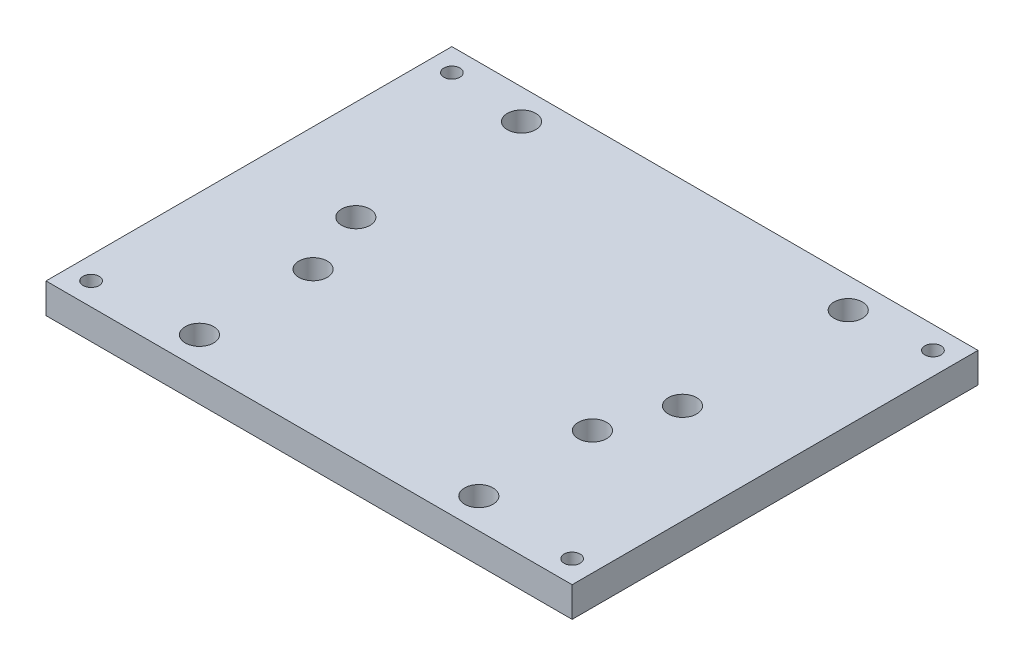
ISO-10303-21;
HEADER;
FILE_DESCRIPTION(('STEP AP214'),'2;1');
FILE_NAME('part.step','',(''),(''),'','','');
FILE_SCHEMA(('AUTOMOTIVE_DESIGN { 1 0 10303 214 1 1 1 1 }'));
ENDSEC;
DATA;
#1=APPLICATION_CONTEXT('core data for automotive mechanical design processes');
#2=APPLICATION_PROTOCOL_DEFINITION('international standard','automotive_design',2000,#1);
#3=PRODUCT_CONTEXT('',#1,'mechanical');
#4=PRODUCT('Part','Part','',(#3));
#5=PRODUCT_RELATED_PRODUCT_CATEGORY('part','',(#4));
#6=PRODUCT_DEFINITION_FORMATION('','',#4);
#7=PRODUCT_DEFINITION_CONTEXT('part definition',#1,'design');
#8=PRODUCT_DEFINITION('design','',#6,#7);
#9=PRODUCT_DEFINITION_SHAPE('','',#8);
#10=(LENGTH_UNIT() NAMED_UNIT(*) SI_UNIT(.MILLI.,.METRE.));
#11=(NAMED_UNIT(*) PLANE_ANGLE_UNIT() SI_UNIT($,.RADIAN.));
#12=(NAMED_UNIT(*) SI_UNIT($,.STERADIAN.) SOLID_ANGLE_UNIT());
#13=UNCERTAINTY_MEASURE_WITH_UNIT(LENGTH_MEASURE(1.E-05),#10,'distance_accuracy_value','');
#14=(GEOMETRIC_REPRESENTATION_CONTEXT(3) GLOBAL_UNCERTAINTY_ASSIGNED_CONTEXT((#13)) GLOBAL_UNIT_ASSIGNED_CONTEXT((#10,
#11,#12)) REPRESENTATION_CONTEXT('',''));
#15=CARTESIAN_POINT('',(0.,0.,0.));
#16=DIRECTION('',(0.,0.,1.));
#17=DIRECTION('',(1.,0.,0.));
#18=AXIS2_PLACEMENT_3D('',#15,#16,#17);
#19=CARTESIAN_POINT('',(-55.5625,6.35,42.8625));
#20=DIRECTION('',(1.,0.,0.));
#21=DIRECTION('',(0.,0.,-1.));
#22=AXIS2_PLACEMENT_3D('',#19,#20,#21);
#23=PLANE('',#22);
#24=DIRECTION('',(0.,0.,1.));
#25=VECTOR('',#24,1.);
#26=CARTESIAN_POINT('',(-55.5625,0.,42.8625));
#27=LINE('',#26,#25);
#28=CARTESIAN_POINT('',(-55.5625,0.,-42.8625));
#29=VERTEX_POINT('',#28);
#30=CARTESIAN_POINT('',(-55.5625,0.,42.8625));
#31=VERTEX_POINT('',#30);
#32=EDGE_CURVE('E98',#29,#31,#27,.T.);
#33=ORIENTED_EDGE('',*,*,#32,.T.);
#34=DIRECTION('',(0.,-1.,0.));
#35=VECTOR('',#34,1.);
#36=CARTESIAN_POINT('',(-55.5625,6.35,42.8625));
#37=LINE('',#36,#35);
#38=CARTESIAN_POINT('',(-55.5625,6.35,42.8625));
#39=VERTEX_POINT('',#38);
#40=EDGE_CURVE('E11',#39,#31,#37,.T.);
#41=ORIENTED_EDGE('',*,*,#40,.F.);
#42=DIRECTION('',(0.,0.,1.));
#43=VECTOR('',#42,1.);
#44=CARTESIAN_POINT('',(-55.5625,6.35,42.8625));
#45=LINE('',#44,#43);
#46=CARTESIAN_POINT('',(-55.5625,6.35,-42.8625));
#47=VERTEX_POINT('',#46);
#48=EDGE_CURVE('E86',#47,#39,#45,.T.);
#49=ORIENTED_EDGE('',*,*,#48,.F.);
#50=DIRECTION('',(0.,-1.,0.));
#51=VECTOR('',#50,1.);
#52=CARTESIAN_POINT('',(-55.5625,6.35,-42.8625));
#53=LINE('',#52,#51);
#54=EDGE_CURVE('E94',#47,#29,#53,.T.);
#55=ORIENTED_EDGE('',*,*,#54,.T.);
#56=EDGE_LOOP('',(#33,#41,#49,#55));
#57=FACE_BOUND('',#56,.T.);
#58=ADVANCED_FACE('F35',(#57),#23,.F.);
#59=CARTESIAN_POINT('',(-55.5625,6.35,42.8625));
#60=DIRECTION('',(0.,0.,-1.));
#61=DIRECTION('',(-1.,0.,0.));
#62=AXIS2_PLACEMENT_3D('',#59,#60,#61);
#63=PLANE('',#62);
#64=DIRECTION('',(1.,0.,0.));
#65=VECTOR('',#64,1.);
#66=CARTESIAN_POINT('',(-55.5625,0.,42.8625));
#67=LINE('',#66,#65);
#68=CARTESIAN_POINT('',(55.5625,0.,42.8625));
#69=VERTEX_POINT('',#68);
#70=EDGE_CURVE('E90',#31,#69,#67,.T.);
#71=ORIENTED_EDGE('',*,*,#70,.T.);
#72=DIRECTION('',(0.,-1.,0.));
#73=VECTOR('',#72,1.);
#74=CARTESIAN_POINT('',(55.5625,6.35,42.8625));
#75=LINE('',#74,#73);
#76=CARTESIAN_POINT('',(55.5625,6.35,42.8625));
#77=VERTEX_POINT('',#76);
#78=EDGE_CURVE('E43',#77,#69,#75,.T.);
#79=ORIENTED_EDGE('',*,*,#78,.F.);
#80=DIRECTION('',(1.,0.,0.));
#81=VECTOR('',#80,1.);
#82=CARTESIAN_POINT('',(-55.5625,6.35,42.8625));
#83=LINE('',#82,#81);
#84=EDGE_CURVE('E81',#39,#77,#83,.T.);
#85=ORIENTED_EDGE('',*,*,#84,.F.);
#86=ORIENTED_EDGE('',*,*,#40,.T.);
#87=EDGE_LOOP('',(#71,#79,#85,#86));
#88=FACE_BOUND('',#87,.T.);
#89=ADVANCED_FACE('F89',(#88),#63,.F.);
#90=CARTESIAN_POINT('',(55.5625,6.35,42.8625));
#91=DIRECTION('',(-1.,0.,0.));
#92=DIRECTION('',(0.,0.,1.));
#93=AXIS2_PLACEMENT_3D('',#90,#91,#92);
#94=PLANE('',#93);
#95=DIRECTION('',(0.,0.,-1.));
#96=VECTOR('',#95,1.);
#97=CARTESIAN_POINT('',(55.5625,0.,42.8625));
#98=LINE('',#97,#96);
#99=CARTESIAN_POINT('',(55.5625,0.,-42.8625));
#100=VERTEX_POINT('',#99);
#101=EDGE_CURVE('E68',#69,#100,#98,.T.);
#102=ORIENTED_EDGE('',*,*,#101,.T.);
#103=DIRECTION('',(0.,-1.,0.));
#104=VECTOR('',#103,1.);
#105=CARTESIAN_POINT('',(55.5625,6.35,-42.8625));
#106=LINE('',#105,#104);
#107=CARTESIAN_POINT('',(55.5625,6.35,-42.8625));
#108=VERTEX_POINT('',#107);
#109=EDGE_CURVE('E91',#108,#100,#106,.T.);
#110=ORIENTED_EDGE('',*,*,#109,.F.);
#111=DIRECTION('',(0.,0.,-1.));
#112=VECTOR('',#111,1.);
#113=CARTESIAN_POINT('',(55.5625,6.35,42.8625));
#114=LINE('',#113,#112);
#115=EDGE_CURVE('E84',#77,#108,#114,.T.);
#116=ORIENTED_EDGE('',*,*,#115,.F.);
#117=ORIENTED_EDGE('',*,*,#78,.T.);
#118=EDGE_LOOP('',(#102,#110,#116,#117));
#119=FACE_BOUND('',#118,.T.);
#120=ADVANCED_FACE('F92',(#119),#94,.F.);
#121=CARTESIAN_POINT('',(-55.5625,6.35,-42.8625));
#122=DIRECTION('',(0.,0.,1.));
#123=DIRECTION('',(1.,0.,0.));
#124=AXIS2_PLACEMENT_3D('',#121,#122,#123);
#125=PLANE('',#124);
#126=DIRECTION('',(-1.,0.,0.));
#127=VECTOR('',#126,1.);
#128=CARTESIAN_POINT('',(-55.5625,0.,-42.8625));
#129=LINE('',#128,#127);
#130=EDGE_CURVE('E74',#100,#29,#129,.T.);
#131=ORIENTED_EDGE('',*,*,#130,.T.);
#132=ORIENTED_EDGE('',*,*,#54,.F.);
#133=DIRECTION('',(-1.,0.,0.));
#134=VECTOR('',#133,1.);
#135=CARTESIAN_POINT('',(-55.5625,6.35,-42.8625));
#136=LINE('',#135,#134);
#137=EDGE_CURVE('E51',#108,#47,#136,.T.);
#138=ORIENTED_EDGE('',*,*,#137,.F.);
#139=ORIENTED_EDGE('',*,*,#109,.T.);
#140=EDGE_LOOP('',(#131,#132,#138,#139));
#141=FACE_BOUND('',#140,.T.);
#142=ADVANCED_FACE('F106',(#141),#125,.F.);
#143=CARTESIAN_POINT('',(0.,6.35,0.));
#144=DIRECTION('',(0.,-1.,0.));
#145=DIRECTION('',(0.,0.,-1.));
#146=AXIS2_PLACEMENT_3D('',#143,#144,#145);
#147=PLANE('',#146);
#148=CARTESIAN_POINT('',(34.5,6.35,-36.5125));
#149=DIRECTION('',(0.,1.,0.));
#150=DIRECTION('',(0.,0.,1.));
#151=AXIS2_PLACEMENT_3D('',#148,#149,#150);
#152=CIRCLE('',#151,3.);
#153=CARTESIAN_POINT('',(34.5,6.35,-33.5125));
#154=VERTEX_POINT('',#153);
#155=EDGE_CURVE('E161',#154,#154,#152,.T.);
#156=ORIENTED_EDGE('',*,*,#155,.F.);
#157=EDGE_LOOP('',(#156));
#158=FACE_BOUND('',#157,.T.);
#159=CARTESIAN_POINT('',(34.5,6.35,-1.51249999999999));
#160=DIRECTION('',(0.,1.,0.));
#161=DIRECTION('',(0.,0.,1.));
#162=AXIS2_PLACEMENT_3D('',#159,#160,#161);
#163=CIRCLE('',#162,3.);
#164=CARTESIAN_POINT('',(34.5,6.35,1.48750000000001));
#165=VERTEX_POINT('',#164);
#166=EDGE_CURVE('E155',#165,#165,#163,.T.);
#167=ORIENTED_EDGE('',*,*,#166,.F.);
#168=EDGE_LOOP('',(#167));
#169=FACE_BOUND('',#168,.T.);
#170=CARTESIAN_POINT('',(-34.5,6.35,-1.51249999999999));
#171=DIRECTION('',(0.,1.,0.));
#172=DIRECTION('',(0.,0.,1.));
#173=AXIS2_PLACEMENT_3D('',#170,#171,#172);
#174=CIRCLE('',#173,3.);
#175=CARTESIAN_POINT('',(-34.5,6.35,1.48750000000001));
#176=VERTEX_POINT('',#175);
#177=EDGE_CURVE('E149',#176,#176,#174,.T.);
#178=ORIENTED_EDGE('',*,*,#177,.F.);
#179=EDGE_LOOP('',(#178));
#180=FACE_BOUND('',#179,.T.);
#181=CARTESIAN_POINT('',(-29.5,6.35,12.5125));
#182=DIRECTION('',(0.,1.,0.));
#183=DIRECTION('',(0.,0.,1.));
#184=AXIS2_PLACEMENT_3D('',#181,#182,#183);
#185=CIRCLE('',#184,3.);
#186=CARTESIAN_POINT('',(-29.5,6.35,15.5125));
#187=VERTEX_POINT('',#186);
#188=EDGE_CURVE('E142',#187,#187,#185,.T.);
#189=ORIENTED_EDGE('',*,*,#188,.F.);
#190=EDGE_LOOP('',(#189));
#191=FACE_BOUND('',#190,.T.);
#192=CARTESIAN_POINT('',(-29.5,6.35,36.5125));
#193=DIRECTION('',(0.,1.,0.));
#194=DIRECTION('',(0.,0.,1.));
#195=AXIS2_PLACEMENT_3D('',#192,#193,#194);
#196=CIRCLE('',#195,3.);
#197=CARTESIAN_POINT('',(-29.5,6.35,39.5125));
#198=VERTEX_POINT('',#197);
#199=EDGE_CURVE('E178',#198,#198,#196,.T.);
#200=ORIENTED_EDGE('',*,*,#199,.F.);
#201=EDGE_LOOP('',(#200));
#202=FACE_BOUND('',#201,.T.);
#203=CARTESIAN_POINT('',(29.5,6.35,36.5125));
#204=DIRECTION('',(0.,1.,0.));
#205=DIRECTION('',(0.,0.,1.));
#206=AXIS2_PLACEMENT_3D('',#203,#204,#205);
#207=CIRCLE('',#206,3.);
#208=CARTESIAN_POINT('',(29.5,6.35,39.5125));
#209=VERTEX_POINT('',#208);
#210=EDGE_CURVE('E172',#209,#209,#207,.T.);
#211=ORIENTED_EDGE('',*,*,#210,.F.);
#212=EDGE_LOOP('',(#211));
#213=FACE_BOUND('',#212,.T.);
#214=CARTESIAN_POINT('',(29.5,6.35,12.5125));
#215=DIRECTION('',(0.,1.,0.));
#216=DIRECTION('',(0.,0.,1.));
#217=AXIS2_PLACEMENT_3D('',#214,#215,#216);
#218=CIRCLE('',#217,3.);
#219=CARTESIAN_POINT('',(29.5,6.35,15.5125));
#220=VERTEX_POINT('',#219);
#221=EDGE_CURVE('E166',#220,#220,#218,.T.);
#222=ORIENTED_EDGE('',*,*,#221,.F.);
#223=EDGE_LOOP('',(#222));
#224=FACE_BOUND('',#223,.T.);
#225=CARTESIAN_POINT('',(-34.5,6.35,-36.5125));
#226=DIRECTION('',(0.,1.,0.));
#227=DIRECTION('',(0.,0.,1.));
#228=AXIS2_PLACEMENT_3D('',#225,#226,#227);
#229=CIRCLE('',#228,3.);
#230=CARTESIAN_POINT('',(-34.5,6.35,-33.5125));
#231=VERTEX_POINT('',#230);
#232=EDGE_CURVE('E136',#231,#231,#229,.T.);
#233=ORIENTED_EDGE('',*,*,#232,.F.);
#234=EDGE_LOOP('',(#233));
#235=FACE_BOUND('',#234,.T.);
#236=CARTESIAN_POINT('',(-50.8,6.35,38.1));
#237=DIRECTION('',(0.,-1.,0.));
#238=DIRECTION('',(0.,0.,-1.));
#239=AXIS2_PLACEMENT_3D('',#236,#237,#238);
#240=CIRCLE('',#239,1.7);
#241=CARTESIAN_POINT('',(-50.8,6.35,36.4));
#242=VERTEX_POINT('',#241);
#243=EDGE_CURVE('E129',#242,#242,#240,.T.);
#244=ORIENTED_EDGE('',*,*,#243,.T.);
#245=EDGE_LOOP('',(#244));
#246=FACE_BOUND('',#245,.T.);
#247=CARTESIAN_POINT('',(50.8,6.35,38.1));
#248=DIRECTION('',(0.,-1.,0.));
#249=DIRECTION('',(0.,0.,-1.));
#250=AXIS2_PLACEMENT_3D('',#247,#248,#249);
#251=CIRCLE('',#250,1.7);
#252=CARTESIAN_POINT('',(50.8,6.35,36.4));
#253=VERTEX_POINT('',#252);
#254=EDGE_CURVE('E123',#253,#253,#251,.T.);
#255=ORIENTED_EDGE('',*,*,#254,.T.);
#256=EDGE_LOOP('',(#255));
#257=FACE_BOUND('',#256,.T.);
#258=CARTESIAN_POINT('',(-50.8,6.35,-38.1));
#259=DIRECTION('',(0.,-1.,0.));
#260=DIRECTION('',(0.,0.,-1.));
#261=AXIS2_PLACEMENT_3D('',#258,#259,#260);
#262=CIRCLE('',#261,1.7);
#263=CARTESIAN_POINT('',(-50.8,6.35,-39.8));
#264=VERTEX_POINT('',#263);
#265=EDGE_CURVE('E117',#264,#264,#262,.T.);
#266=ORIENTED_EDGE('',*,*,#265,.T.);
#267=EDGE_LOOP('',(#266));
#268=FACE_BOUND('',#267,.T.);
#269=CARTESIAN_POINT('',(50.8,6.35,-38.1));
#270=DIRECTION('',(0.,-1.,0.));
#271=DIRECTION('',(0.,0.,-1.));
#272=AXIS2_PLACEMENT_3D('',#269,#270,#271);
#273=CIRCLE('',#272,1.7);
#274=CARTESIAN_POINT('',(50.8,6.35,-39.8));
#275=VERTEX_POINT('',#274);
#276=EDGE_CURVE('E101',#275,#275,#273,.T.);
#277=ORIENTED_EDGE('',*,*,#276,.T.);
#278=EDGE_LOOP('',(#277));
#279=FACE_BOUND('',#278,.T.);
#280=ORIENTED_EDGE('',*,*,#48,.T.);
#281=ORIENTED_EDGE('',*,*,#84,.T.);
#282=ORIENTED_EDGE('',*,*,#115,.T.);
#283=ORIENTED_EDGE('',*,*,#137,.T.);
#284=EDGE_LOOP('',(#280,#281,#282,#283));
#285=FACE_BOUND('',#284,.T.);
#286=ADVANCED_FACE('F82',(#158,#169,#180,#191,#202,#213,#224,#235,#246,#257,#268,#279,#285),
#147,.F.);
#287=CARTESIAN_POINT('',(0.,0.,0.));
#288=DIRECTION('',(0.,-1.,0.));
#289=DIRECTION('',(0.,0.,-1.));
#290=AXIS2_PLACEMENT_3D('',#287,#288,#289);
#291=PLANE('',#290);
#292=CARTESIAN_POINT('',(34.5,0.,-36.5125));
#293=DIRECTION('',(0.,1.,0.));
#294=DIRECTION('',(0.,0.,1.));
#295=AXIS2_PLACEMENT_3D('',#292,#293,#294);
#296=CIRCLE('',#295,3.);
#297=CARTESIAN_POINT('',(34.5,0.,-33.5125));
#298=VERTEX_POINT('',#297);
#299=EDGE_CURVE('E139',#298,#298,#296,.T.);
#300=ORIENTED_EDGE('',*,*,#299,.T.);
#301=EDGE_LOOP('',(#300));
#302=FACE_BOUND('',#301,.T.);
#303=CARTESIAN_POINT('',(34.5,0.,-1.51249999999999));
#304=DIRECTION('',(0.,1.,0.));
#305=DIRECTION('',(0.,0.,1.));
#306=AXIS2_PLACEMENT_3D('',#303,#304,#305);
#307=CIRCLE('',#306,3.);
#308=CARTESIAN_POINT('',(34.5,0.,1.48750000000001));
#309=VERTEX_POINT('',#308);
#310=EDGE_CURVE('E158',#309,#309,#307,.T.);
#311=ORIENTED_EDGE('',*,*,#310,.T.);
#312=EDGE_LOOP('',(#311));
#313=FACE_BOUND('',#312,.T.);
#314=CARTESIAN_POINT('',(-34.5,0.,-1.51249999999999));
#315=DIRECTION('',(0.,1.,0.));
#316=DIRECTION('',(0.,0.,1.));
#317=AXIS2_PLACEMENT_3D('',#314,#315,#316);
#318=CIRCLE('',#317,3.);
#319=CARTESIAN_POINT('',(-34.5,0.,1.48750000000001));
#320=VERTEX_POINT('',#319);
#321=EDGE_CURVE('E152',#320,#320,#318,.T.);
#322=ORIENTED_EDGE('',*,*,#321,.T.);
#323=EDGE_LOOP('',(#322));
#324=FACE_BOUND('',#323,.T.);
#325=CARTESIAN_POINT('',(-29.5,0.,12.5125));
#326=DIRECTION('',(0.,1.,0.));
#327=DIRECTION('',(0.,0.,1.));
#328=AXIS2_PLACEMENT_3D('',#325,#326,#327);
#329=CIRCLE('',#328,3.);
#330=CARTESIAN_POINT('',(-29.5,0.,15.5125));
#331=VERTEX_POINT('',#330);
#332=EDGE_CURVE('E145',#331,#331,#329,.T.);
#333=ORIENTED_EDGE('',*,*,#332,.T.);
#334=EDGE_LOOP('',(#333));
#335=FACE_BOUND('',#334,.T.);
#336=CARTESIAN_POINT('',(-29.5,0.,36.5125));
#337=DIRECTION('',(0.,1.,0.));
#338=DIRECTION('',(0.,0.,1.));
#339=AXIS2_PLACEMENT_3D('',#336,#337,#338);
#340=CIRCLE('',#339,3.);
#341=CARTESIAN_POINT('',(-29.5,0.,39.5125));
#342=VERTEX_POINT('',#341);
#343=EDGE_CURVE('E146',#342,#342,#340,.T.);
#344=ORIENTED_EDGE('',*,*,#343,.T.);
#345=EDGE_LOOP('',(#344));
#346=FACE_BOUND('',#345,.T.);
#347=CARTESIAN_POINT('',(29.5,0.,36.5125));
#348=DIRECTION('',(0.,1.,0.));
#349=DIRECTION('',(0.,0.,1.));
#350=AXIS2_PLACEMENT_3D('',#347,#348,#349);
#351=CIRCLE('',#350,3.);
#352=CARTESIAN_POINT('',(29.5,0.,39.5125));
#353=VERTEX_POINT('',#352);
#354=EDGE_CURVE('E175',#353,#353,#351,.T.);
#355=ORIENTED_EDGE('',*,*,#354,.T.);
#356=EDGE_LOOP('',(#355));
#357=FACE_BOUND('',#356,.T.);
#358=CARTESIAN_POINT('',(29.5,0.,12.5125));
#359=DIRECTION('',(0.,1.,0.));
#360=DIRECTION('',(0.,0.,1.));
#361=AXIS2_PLACEMENT_3D('',#358,#359,#360);
#362=CIRCLE('',#361,3.);
#363=CARTESIAN_POINT('',(29.5,0.,15.5125));
#364=VERTEX_POINT('',#363);
#365=EDGE_CURVE('E169',#364,#364,#362,.T.);
#366=ORIENTED_EDGE('',*,*,#365,.T.);
#367=EDGE_LOOP('',(#366));
#368=FACE_BOUND('',#367,.T.);
#369=CARTESIAN_POINT('',(-34.5,0.,-36.5125));
#370=DIRECTION('',(0.,1.,0.));
#371=DIRECTION('',(0.,0.,1.));
#372=AXIS2_PLACEMENT_3D('',#369,#370,#371);
#373=CIRCLE('',#372,3.);
#374=CARTESIAN_POINT('',(-34.5,0.,-33.5125));
#375=VERTEX_POINT('',#374);
#376=EDGE_CURVE('E135',#375,#375,#373,.T.);
#377=ORIENTED_EDGE('',*,*,#376,.T.);
#378=EDGE_LOOP('',(#377));
#379=FACE_BOUND('',#378,.T.);
#380=CARTESIAN_POINT('',(-50.8,0.,38.1));
#381=DIRECTION('',(0.,-1.,0.));
#382=DIRECTION('',(0.,0.,-1.));
#383=AXIS2_PLACEMENT_3D('',#380,#381,#382);
#384=CIRCLE('',#383,1.69999999999999);
#385=CARTESIAN_POINT('',(-50.8,0.,36.4));
#386=VERTEX_POINT('',#385);
#387=EDGE_CURVE('E132',#386,#386,#384,.T.);
#388=ORIENTED_EDGE('',*,*,#387,.F.);
#389=EDGE_LOOP('',(#388));
#390=FACE_BOUND('',#389,.T.);
#391=CARTESIAN_POINT('',(50.8,0.,38.1));
#392=DIRECTION('',(0.,-1.,0.));
#393=DIRECTION('',(0.,0.,-1.));
#394=AXIS2_PLACEMENT_3D('',#391,#392,#393);
#395=CIRCLE('',#394,1.69999999999999);
#396=CARTESIAN_POINT('',(50.8,0.,36.4));
#397=VERTEX_POINT('',#396);
#398=EDGE_CURVE('E126',#397,#397,#395,.T.);
#399=ORIENTED_EDGE('',*,*,#398,.F.);
#400=EDGE_LOOP('',(#399));
#401=FACE_BOUND('',#400,.T.);
#402=CARTESIAN_POINT('',(-50.8,0.,-38.1));
#403=DIRECTION('',(0.,-1.,0.));
#404=DIRECTION('',(0.,0.,-1.));
#405=AXIS2_PLACEMENT_3D('',#402,#403,#404);
#406=CIRCLE('',#405,1.69999999999999);
#407=CARTESIAN_POINT('',(-50.8,0.,-39.8));
#408=VERTEX_POINT('',#407);
#409=EDGE_CURVE('E120',#408,#408,#406,.T.);
#410=ORIENTED_EDGE('',*,*,#409,.F.);
#411=EDGE_LOOP('',(#410));
#412=FACE_BOUND('',#411,.T.);
#413=CARTESIAN_POINT('',(50.8,0.,-38.1));
#414=DIRECTION('',(0.,-1.,0.));
#415=DIRECTION('',(0.,0.,-1.));
#416=AXIS2_PLACEMENT_3D('',#413,#414,#415);
#417=CIRCLE('',#416,1.69999999999999);
#418=CARTESIAN_POINT('',(50.8,0.,-39.8));
#419=VERTEX_POINT('',#418);
#420=EDGE_CURVE('E114',#419,#419,#417,.T.);
#421=ORIENTED_EDGE('',*,*,#420,.F.);
#422=EDGE_LOOP('',(#421));
#423=FACE_BOUND('',#422,.T.);
#424=ORIENTED_EDGE('',*,*,#32,.F.);
#425=ORIENTED_EDGE('',*,*,#130,.F.);
#426=ORIENTED_EDGE('',*,*,#101,.F.);
#427=ORIENTED_EDGE('',*,*,#70,.F.);
#428=EDGE_LOOP('',(#424,#425,#426,#427));
#429=FACE_BOUND('',#428,.T.);
#430=ADVANCED_FACE('F109',(#302,#313,#324,#335,#346,#357,#368,#379,#390,#401,#412,#423,#429),
#291,.T.);
#431=CARTESIAN_POINT('',(50.8,0.,-38.1));
#432=DIRECTION('',(0.,-1.,0.));
#433=DIRECTION('',(0.,0.,-1.));
#434=AXIS2_PLACEMENT_3D('',#431,#432,#433);
#435=CYLINDRICAL_SURFACE('',#434,1.69999999999999);
#436=ORIENTED_EDGE('',*,*,#276,.F.);
#437=EDGE_LOOP('',(#436));
#438=FACE_BOUND('',#437,.T.);
#439=ORIENTED_EDGE('',*,*,#420,.T.);
#440=EDGE_LOOP('',(#439));
#441=FACE_BOUND('',#440,.T.);
#442=ADVANCED_FACE('F212',(#438,#441),#435,.F.);
#443=CARTESIAN_POINT('',(-50.8,0.,-38.1));
#444=DIRECTION('',(0.,-1.,0.));
#445=DIRECTION('',(0.,0.,-1.));
#446=AXIS2_PLACEMENT_3D('',#443,#444,#445);
#447=CYLINDRICAL_SURFACE('',#446,1.69999999999999);
#448=ORIENTED_EDGE('',*,*,#265,.F.);
#449=EDGE_LOOP('',(#448));
#450=FACE_BOUND('',#449,.T.);
#451=ORIENTED_EDGE('',*,*,#409,.T.);
#452=EDGE_LOOP('',(#451));
#453=FACE_BOUND('',#452,.T.);
#454=ADVANCED_FACE('F215',(#450,#453),#447,.F.);
#455=CARTESIAN_POINT('',(50.8,0.,38.1));
#456=DIRECTION('',(0.,-1.,0.));
#457=DIRECTION('',(0.,0.,-1.));
#458=AXIS2_PLACEMENT_3D('',#455,#456,#457);
#459=CYLINDRICAL_SURFACE('',#458,1.69999999999999);
#460=ORIENTED_EDGE('',*,*,#254,.F.);
#461=EDGE_LOOP('',(#460));
#462=FACE_BOUND('',#461,.T.);
#463=ORIENTED_EDGE('',*,*,#398,.T.);
#464=EDGE_LOOP('',(#463));
#465=FACE_BOUND('',#464,.T.);
#466=ADVANCED_FACE('F337',(#462,#465),#459,.F.);
#467=CARTESIAN_POINT('',(-50.8,0.,38.1));
#468=DIRECTION('',(0.,-1.,0.));
#469=DIRECTION('',(0.,0.,-1.));
#470=AXIS2_PLACEMENT_3D('',#467,#468,#469);
#471=CYLINDRICAL_SURFACE('',#470,1.69999999999999);
#472=ORIENTED_EDGE('',*,*,#243,.F.);
#473=EDGE_LOOP('',(#472));
#474=FACE_BOUND('',#473,.T.);
#475=ORIENTED_EDGE('',*,*,#387,.T.);
#476=EDGE_LOOP('',(#475));
#477=FACE_BOUND('',#476,.T.);
#478=ADVANCED_FACE('F250',(#474,#477),#471,.F.);
#479=CARTESIAN_POINT('',(-34.5,0.,-36.5125));
#480=DIRECTION('',(0.,1.,0.));
#481=DIRECTION('',(0.,0.,1.));
#482=AXIS2_PLACEMENT_3D('',#479,#480,#481);
#483=CYLINDRICAL_SURFACE('',#482,3.);
#484=ORIENTED_EDGE('',*,*,#376,.F.);
#485=EDGE_LOOP('',(#484));
#486=FACE_BOUND('',#485,.T.);
#487=ORIENTED_EDGE('',*,*,#232,.T.);
#488=EDGE_LOOP('',(#487));
#489=FACE_BOUND('',#488,.T.);
#490=ADVANCED_FACE('F260',(#486,#489),#483,.F.);
#491=CARTESIAN_POINT('',(29.5,0.,12.5125));
#492=DIRECTION('',(0.,1.,0.));
#493=DIRECTION('',(0.,0.,1.));
#494=AXIS2_PLACEMENT_3D('',#491,#492,#493);
#495=CYLINDRICAL_SURFACE('',#494,3.);
#496=ORIENTED_EDGE('',*,*,#365,.F.);
#497=EDGE_LOOP('',(#496));
#498=FACE_BOUND('',#497,.T.);
#499=ORIENTED_EDGE('',*,*,#221,.T.);
#500=EDGE_LOOP('',(#499));
#501=FACE_BOUND('',#500,.T.);
#502=ADVANCED_FACE('F265',(#498,#501),#495,.F.);
#503=CARTESIAN_POINT('',(29.5,0.,36.5125));
#504=DIRECTION('',(0.,1.,0.));
#505=DIRECTION('',(0.,0.,1.));
#506=AXIS2_PLACEMENT_3D('',#503,#504,#505);
#507=CYLINDRICAL_SURFACE('',#506,3.);
#508=ORIENTED_EDGE('',*,*,#354,.F.);
#509=EDGE_LOOP('',(#508));
#510=FACE_BOUND('',#509,.T.);
#511=ORIENTED_EDGE('',*,*,#210,.T.);
#512=EDGE_LOOP('',(#511));
#513=FACE_BOUND('',#512,.T.);
#514=ADVANCED_FACE('F190',(#510,#513),#507,.F.);
#515=CARTESIAN_POINT('',(-29.5,0.,36.5125));
#516=DIRECTION('',(0.,1.,0.));
#517=DIRECTION('',(0.,0.,1.));
#518=AXIS2_PLACEMENT_3D('',#515,#516,#517);
#519=CYLINDRICAL_SURFACE('',#518,3.);
#520=ORIENTED_EDGE('',*,*,#343,.F.);
#521=EDGE_LOOP('',(#520));
#522=FACE_BOUND('',#521,.T.);
#523=ORIENTED_EDGE('',*,*,#199,.T.);
#524=EDGE_LOOP('',(#523));
#525=FACE_BOUND('',#524,.T.);
#526=ADVANCED_FACE('F186',(#522,#525),#519,.F.);
#527=CARTESIAN_POINT('',(-29.5,0.,12.5125));
#528=DIRECTION('',(0.,1.,0.));
#529=DIRECTION('',(0.,0.,1.));
#530=AXIS2_PLACEMENT_3D('',#527,#528,#529);
#531=CYLINDRICAL_SURFACE('',#530,3.);
#532=ORIENTED_EDGE('',*,*,#332,.F.);
#533=EDGE_LOOP('',(#532));
#534=FACE_BOUND('',#533,.T.);
#535=ORIENTED_EDGE('',*,*,#188,.T.);
#536=EDGE_LOOP('',(#535));
#537=FACE_BOUND('',#536,.T.);
#538=ADVANCED_FACE('F189',(#534,#537),#531,.F.);
#539=CARTESIAN_POINT('',(-34.5,0.,-1.51249999999999));
#540=DIRECTION('',(0.,1.,0.));
#541=DIRECTION('',(0.,0.,1.));
#542=AXIS2_PLACEMENT_3D('',#539,#540,#541);
#543=CYLINDRICAL_SURFACE('',#542,3.);
#544=ORIENTED_EDGE('',*,*,#321,.F.);
#545=EDGE_LOOP('',(#544));
#546=FACE_BOUND('',#545,.T.);
#547=ORIENTED_EDGE('',*,*,#177,.T.);
#548=EDGE_LOOP('',(#547));
#549=FACE_BOUND('',#548,.T.);
#550=ADVANCED_FACE('F299',(#546,#549),#543,.F.);
#551=CARTESIAN_POINT('',(34.5,0.,-1.51249999999999));
#552=DIRECTION('',(0.,1.,0.));
#553=DIRECTION('',(0.,0.,1.));
#554=AXIS2_PLACEMENT_3D('',#551,#552,#553);
#555=CYLINDRICAL_SURFACE('',#554,3.);
#556=ORIENTED_EDGE('',*,*,#310,.F.);
#557=EDGE_LOOP('',(#556));
#558=FACE_BOUND('',#557,.T.);
#559=ORIENTED_EDGE('',*,*,#166,.T.);
#560=EDGE_LOOP('',(#559));
#561=FACE_BOUND('',#560,.T.);
#562=ADVANCED_FACE('F309',(#558,#561),#555,.F.);
#563=CARTESIAN_POINT('',(34.5,0.,-36.5125));
#564=DIRECTION('',(0.,1.,0.));
#565=DIRECTION('',(0.,0.,1.));
#566=AXIS2_PLACEMENT_3D('',#563,#564,#565);
#567=CYLINDRICAL_SURFACE('',#566,3.);
#568=ORIENTED_EDGE('',*,*,#299,.F.);
#569=EDGE_LOOP('',(#568));
#570=FACE_BOUND('',#569,.T.);
#571=ORIENTED_EDGE('',*,*,#155,.T.);
#572=EDGE_LOOP('',(#571));
#573=FACE_BOUND('',#572,.T.);
#574=ADVANCED_FACE('F319',(#570,#573),#567,.F.);
#575=CLOSED_SHELL('',(#58,#89,#120,#142,#286,#430,#442,#454,#466,#478,#490,#502,#514,#526,#538,
#550,#562,#574));
#576=MANIFOLD_SOLID_BREP('B2',#575);
#577=ADVANCED_BREP_SHAPE_REPRESENTATION('',(#18,#576),#14);
#578=SHAPE_DEFINITION_REPRESENTATION(#9,#577);
ENDSEC;
END-ISO-10303-21;
